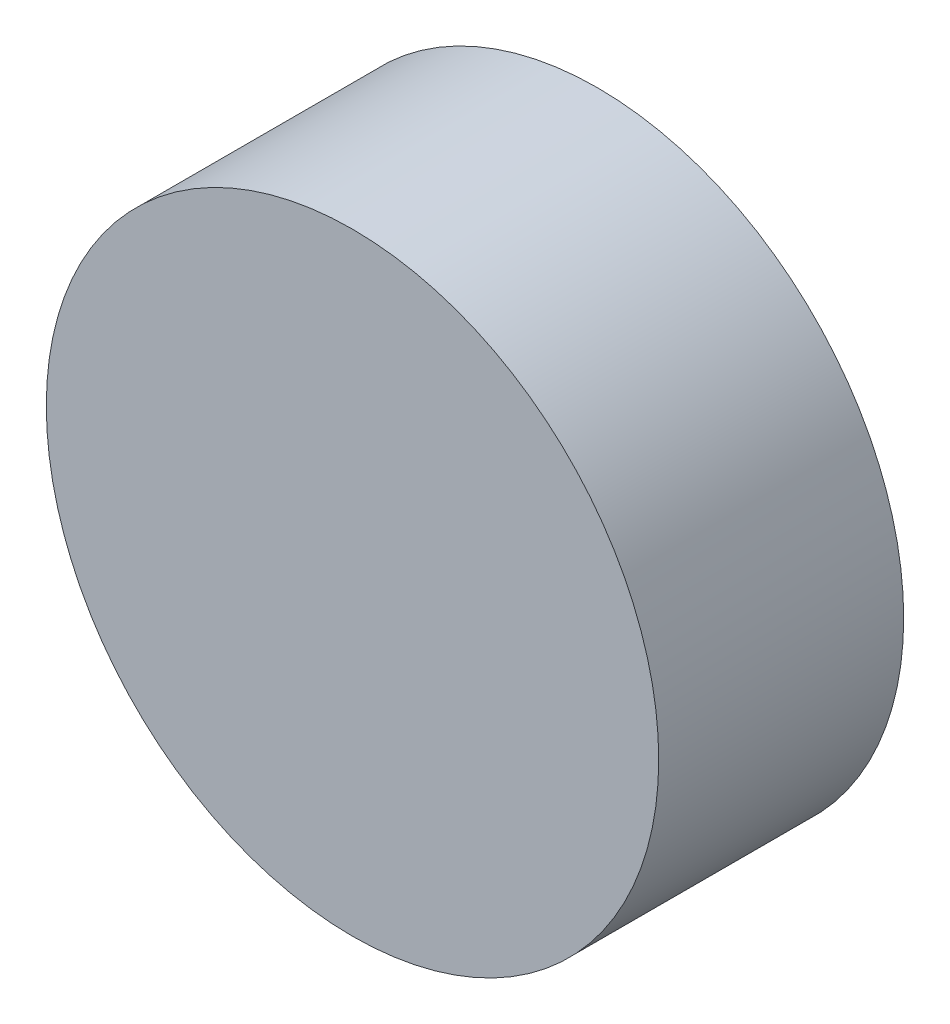
ISO-10303-21;
HEADER;
FILE_DESCRIPTION(('STEP AP214'),'2;1');
FILE_NAME('part.step','',(''),(''),'','','');
FILE_SCHEMA(('AUTOMOTIVE_DESIGN { 1 0 10303 214 1 1 1 1 }'));
ENDSEC;
DATA;
#1=APPLICATION_CONTEXT('core data for automotive mechanical design processes');
#2=APPLICATION_PROTOCOL_DEFINITION('international standard','automotive_design',2000,#1);
#3=PRODUCT_CONTEXT('',#1,'mechanical');
#4=PRODUCT('Part','Part','',(#3));
#5=PRODUCT_RELATED_PRODUCT_CATEGORY('part','',(#4));
#6=PRODUCT_DEFINITION_FORMATION('','',#4);
#7=PRODUCT_DEFINITION_CONTEXT('part definition',#1,'design');
#8=PRODUCT_DEFINITION('design','',#6,#7);
#9=PRODUCT_DEFINITION_SHAPE('','',#8);
#10=(LENGTH_UNIT() NAMED_UNIT(*) SI_UNIT(.MILLI.,.METRE.));
#11=(NAMED_UNIT(*) PLANE_ANGLE_UNIT() SI_UNIT($,.RADIAN.));
#12=(NAMED_UNIT(*) SI_UNIT($,.STERADIAN.) SOLID_ANGLE_UNIT());
#13=UNCERTAINTY_MEASURE_WITH_UNIT(LENGTH_MEASURE(1.E-05),#10,'distance_accuracy_value','');
#14=(GEOMETRIC_REPRESENTATION_CONTEXT(3) GLOBAL_UNCERTAINTY_ASSIGNED_CONTEXT((#13)) GLOBAL_UNIT_ASSIGNED_CONTEXT((#10,
#11,#12)) REPRESENTATION_CONTEXT('',''));
#15=CARTESIAN_POINT('',(0.,0.,0.));
#16=DIRECTION('',(0.,0.,1.));
#17=DIRECTION('',(1.,0.,0.));
#18=AXIS2_PLACEMENT_3D('',#15,#16,#17);
#19=CARTESIAN_POINT('',(0.,0.,2.));
#20=DIRECTION('',(0.,0.,-1.));
#21=DIRECTION('',(-1.,0.,0.));
#22=AXIS2_PLACEMENT_3D('',#19,#20,#21);
#23=CYLINDRICAL_SURFACE('',#22,2.5);
#24=CARTESIAN_POINT('',(0.,0.,2.));
#25=DIRECTION('',(0.,0.,1.));
#26=DIRECTION('',(1.,0.,0.));
#27=AXIS2_PLACEMENT_3D('',#24,#25,#26);
#28=CIRCLE('',#27,2.5);
#29=CARTESIAN_POINT('',(2.5,0.,2.));
#30=VERTEX_POINT('',#29);
#31=EDGE_CURVE('E10',#30,#30,#28,.T.);
#32=ORIENTED_EDGE('',*,*,#31,.F.);
#33=EDGE_LOOP('',(#32));
#34=FACE_BOUND('',#33,.T.);
#35=CARTESIAN_POINT('',(0.,0.,0.));
#36=DIRECTION('',(0.,0.,1.));
#37=DIRECTION('',(1.,0.,0.));
#38=AXIS2_PLACEMENT_3D('',#35,#36,#37);
#39=CIRCLE('',#38,2.5);
#40=CARTESIAN_POINT('',(2.5,0.,0.));
#41=VERTEX_POINT('',#40);
#42=EDGE_CURVE('E42',#41,#41,#39,.T.);
#43=ORIENTED_EDGE('',*,*,#42,.T.);
#44=EDGE_LOOP('',(#43));
#45=FACE_BOUND('',#44,.T.);
#46=ADVANCED_FACE('F39',(#34,#45),#23,.T.);
#47=CARTESIAN_POINT('',(0.,0.,2.));
#48=DIRECTION('',(0.,0.,1.));
#49=DIRECTION('',(1.,0.,0.));
#50=AXIS2_PLACEMENT_3D('',#47,#48,#49);
#51=PLANE('',#50);
#52=ORIENTED_EDGE('',*,*,#31,.T.);
#53=EDGE_LOOP('',(#52));
#54=FACE_BOUND('',#53,.T.);
#55=ADVANCED_FACE('F54',(#54),#51,.T.);
#56=CARTESIAN_POINT('',(0.,0.,0.));
#57=DIRECTION('',(0.,0.,1.));
#58=DIRECTION('',(1.,0.,0.));
#59=AXIS2_PLACEMENT_3D('',#56,#57,#58);
#60=PLANE('',#59);
#61=ORIENTED_EDGE('',*,*,#42,.F.);
#62=EDGE_LOOP('',(#61));
#63=FACE_BOUND('',#62,.T.);
#64=ADVANCED_FACE('F52',(#63),#60,.F.);
#65=CLOSED_SHELL('',(#46,#55,#64));
#66=MANIFOLD_SOLID_BREP('B2',#65);
#67=ADVANCED_BREP_SHAPE_REPRESENTATION('',(#18,#66),#14);
#68=SHAPE_DEFINITION_REPRESENTATION(#9,#67);
ENDSEC;
END-ISO-10303-21;
